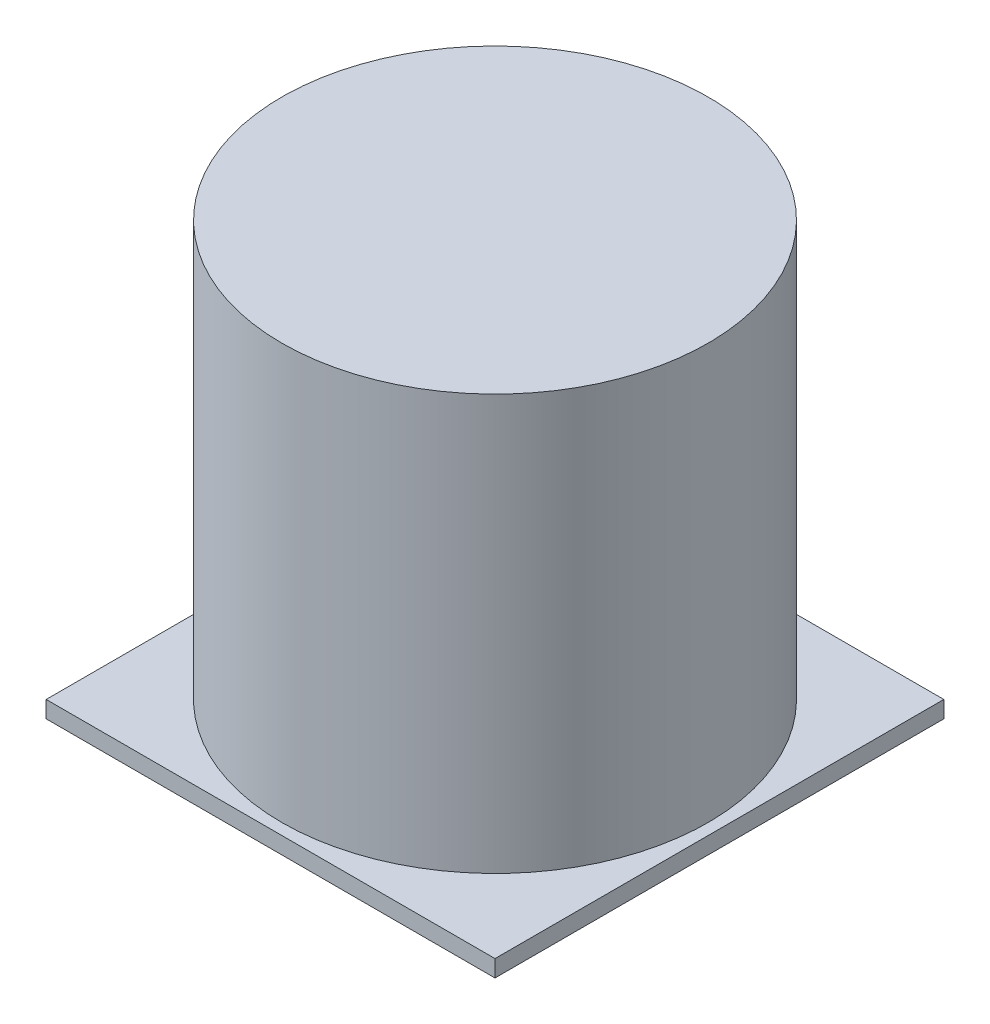
ISO-10303-21;
HEADER;
FILE_DESCRIPTION(('STEP AP214'),'2;1');
FILE_NAME('part.step','',(''),(''),'','','');
FILE_SCHEMA(('AUTOMOTIVE_DESIGN { 1 0 10303 214 1 1 1 1 }'));
ENDSEC;
DATA;
#1=APPLICATION_CONTEXT('core data for automotive mechanical design processes');
#2=APPLICATION_PROTOCOL_DEFINITION('international standard','automotive_design',2000,#1);
#3=PRODUCT_CONTEXT('',#1,'mechanical');
#4=PRODUCT('Part','Part','',(#3));
#5=PRODUCT_RELATED_PRODUCT_CATEGORY('part','',(#4));
#6=PRODUCT_DEFINITION_FORMATION('','',#4);
#7=PRODUCT_DEFINITION_CONTEXT('part definition',#1,'design');
#8=PRODUCT_DEFINITION('design','',#6,#7);
#9=PRODUCT_DEFINITION_SHAPE('','',#8);
#10=(LENGTH_UNIT() NAMED_UNIT(*) SI_UNIT(.MILLI.,.METRE.));
#11=(NAMED_UNIT(*) PLANE_ANGLE_UNIT() SI_UNIT($,.RADIAN.));
#12=(NAMED_UNIT(*) SI_UNIT($,.STERADIAN.) SOLID_ANGLE_UNIT());
#13=UNCERTAINTY_MEASURE_WITH_UNIT(LENGTH_MEASURE(1.E-05),#10,'distance_accuracy_value','');
#14=(GEOMETRIC_REPRESENTATION_CONTEXT(3) GLOBAL_UNCERTAINTY_ASSIGNED_CONTEXT((#13)) GLOBAL_UNIT_ASSIGNED_CONTEXT((#10,
#11,#12)) REPRESENTATION_CONTEXT('',''));
#15=CARTESIAN_POINT('',(0.,0.,0.));
#16=DIRECTION('',(0.,0.,1.));
#17=DIRECTION('',(1.,0.,0.));
#18=AXIS2_PLACEMENT_3D('',#15,#16,#17);
#19=CARTESIAN_POINT('',(0.,3.,0.));
#20=DIRECTION('',(0.,1.,0.));
#21=DIRECTION('',(0.,0.,1.));
#22=AXIS2_PLACEMENT_3D('',#19,#20,#21);
#23=PLANE('',#22);
#24=DIRECTION('',(-1.,0.,0.));
#25=VECTOR('',#24,1.);
#26=CARTESIAN_POINT('',(80.,3.,-40.));
#27=LINE('',#26,#25);
#28=CARTESIAN_POINT('',(80.,3.,-40.));
#29=VERTEX_POINT('',#28);
#30=CARTESIAN_POINT('',(0.,3.,-40.));
#31=VERTEX_POINT('',#30);
#32=EDGE_CURVE('E138',#29,#31,#27,.T.);
#33=ORIENTED_EDGE('',*,*,#32,.T.);
#34=DIRECTION('',(0.,0.,1.));
#35=VECTOR('',#34,1.);
#36=CARTESIAN_POINT('',(0.,3.,-40.));
#37=LINE('',#36,#35);
#38=CARTESIAN_POINT('',(0.,3.,40.));
#39=VERTEX_POINT('',#38);
#40=EDGE_CURVE('E90',#31,#39,#37,.T.);
#41=ORIENTED_EDGE('',*,*,#40,.T.);
#42=DIRECTION('',(1.,0.,0.));
#43=VECTOR('',#42,1.);
#44=CARTESIAN_POINT('',(0.,3.,40.));
#45=LINE('',#44,#43);
#46=CARTESIAN_POINT('',(80.,3.,40.));
#47=VERTEX_POINT('',#46);
#48=EDGE_CURVE('E151',#39,#47,#45,.T.);
#49=ORIENTED_EDGE('',*,*,#48,.T.);
#50=DIRECTION('',(0.,0.,-1.));
#51=VECTOR('',#50,1.);
#52=CARTESIAN_POINT('',(80.,3.,40.));
#53=LINE('',#52,#51);
#54=EDGE_CURVE('E58',#47,#29,#53,.T.);
#55=ORIENTED_EDGE('',*,*,#54,.T.);
#56=EDGE_LOOP('',(#33,#41,#49,#55));
#57=FACE_BOUND('',#56,.T.);
#58=CARTESIAN_POINT('',(40.,3.,0.));
#59=DIRECTION('',(0.,1.,0.));
#60=DIRECTION('',(0.,0.,1.));
#61=AXIS2_PLACEMENT_3D('',#58,#59,#60);
#62=CIRCLE('',#61,38.);
#63=CARTESIAN_POINT('',(40.,3.,38.));
#64=VERTEX_POINT('',#63);
#65=EDGE_CURVE('E142',#64,#64,#62,.T.);
#66=ORIENTED_EDGE('',*,*,#65,.F.);
#67=EDGE_LOOP('',(#66));
#68=FACE_BOUND('',#67,.T.);
#69=ADVANCED_FACE('F40',(#57,#68),#23,.T.);
#70=CARTESIAN_POINT('',(80.,3.,-40.));
#71=DIRECTION('',(0.,0.,1.));
#72=DIRECTION('',(1.,0.,0.));
#73=AXIS2_PLACEMENT_3D('',#70,#71,#72);
#74=PLANE('',#73);
#75=DIRECTION('',(-1.,0.,0.));
#76=VECTOR('',#75,1.);
#77=CARTESIAN_POINT('',(80.,0.,-40.));
#78=LINE('',#77,#76);
#79=CARTESIAN_POINT('',(80.,0.,-40.));
#80=VERTEX_POINT('',#79);
#81=CARTESIAN_POINT('',(0.,0.,-40.));
#82=VERTEX_POINT('',#81);
#83=EDGE_CURVE('E146',#80,#82,#78,.T.);
#84=ORIENTED_EDGE('',*,*,#83,.T.);
#85=DIRECTION('',(0.,-1.,0.));
#86=VECTOR('',#85,1.);
#87=CARTESIAN_POINT('',(0.,3.,-40.));
#88=LINE('',#87,#86);
#89=EDGE_CURVE('E166',#31,#82,#88,.T.);
#90=ORIENTED_EDGE('',*,*,#89,.F.);
#91=ORIENTED_EDGE('',*,*,#32,.F.);
#92=DIRECTION('',(0.,-1.,0.));
#93=VECTOR('',#92,1.);
#94=CARTESIAN_POINT('',(80.,3.,-40.));
#95=LINE('',#94,#93);
#96=EDGE_CURVE('E154',#29,#80,#95,.T.);
#97=ORIENTED_EDGE('',*,*,#96,.T.);
#98=EDGE_LOOP('',(#84,#90,#91,#97));
#99=FACE_BOUND('',#98,.T.);
#100=ADVANCED_FACE('F42',(#99),#74,.F.);
#101=CARTESIAN_POINT('',(0.,3.,-40.));
#102=DIRECTION('',(1.,0.,0.));
#103=DIRECTION('',(0.,0.,-1.));
#104=AXIS2_PLACEMENT_3D('',#101,#102,#103);
#105=PLANE('',#104);
#106=DIRECTION('',(0.,0.,1.));
#107=VECTOR('',#106,1.);
#108=CARTESIAN_POINT('',(0.,0.,-40.));
#109=LINE('',#108,#107);
#110=CARTESIAN_POINT('',(0.,0.,40.));
#111=VERTEX_POINT('',#110);
#112=EDGE_CURVE('E157',#82,#111,#109,.T.);
#113=ORIENTED_EDGE('',*,*,#112,.T.);
#114=DIRECTION('',(0.,-1.,0.));
#115=VECTOR('',#114,1.);
#116=CARTESIAN_POINT('',(0.,3.,40.));
#117=LINE('',#116,#115);
#118=EDGE_CURVE('E164',#39,#111,#117,.T.);
#119=ORIENTED_EDGE('',*,*,#118,.F.);
#120=ORIENTED_EDGE('',*,*,#40,.F.);
#121=ORIENTED_EDGE('',*,*,#89,.T.);
#122=EDGE_LOOP('',(#113,#119,#120,#121));
#123=FACE_BOUND('',#122,.T.);
#124=ADVANCED_FACE('F127',(#123),#105,.F.);
#125=CARTESIAN_POINT('',(0.,3.,40.));
#126=DIRECTION('',(0.,0.,-1.));
#127=DIRECTION('',(-1.,0.,0.));
#128=AXIS2_PLACEMENT_3D('',#125,#126,#127);
#129=PLANE('',#128);
#130=DIRECTION('',(1.,0.,0.));
#131=VECTOR('',#130,1.);
#132=CARTESIAN_POINT('',(0.,0.,40.));
#133=LINE('',#132,#131);
#134=CARTESIAN_POINT('',(80.,0.,40.));
#135=VERTEX_POINT('',#134);
#136=EDGE_CURVE('E76',#111,#135,#133,.T.);
#137=ORIENTED_EDGE('',*,*,#136,.T.);
#138=DIRECTION('',(0.,-1.,0.));
#139=VECTOR('',#138,1.);
#140=CARTESIAN_POINT('',(80.,3.,40.));
#141=LINE('',#140,#139);
#142=EDGE_CURVE('E162',#47,#135,#141,.T.);
#143=ORIENTED_EDGE('',*,*,#142,.F.);
#144=ORIENTED_EDGE('',*,*,#48,.F.);
#145=ORIENTED_EDGE('',*,*,#118,.T.);
#146=EDGE_LOOP('',(#137,#143,#144,#145));
#147=FACE_BOUND('',#146,.T.);
#148=ADVANCED_FACE('F125',(#147),#129,.F.);
#149=CARTESIAN_POINT('',(80.,3.,40.));
#150=DIRECTION('',(-1.,0.,0.));
#151=DIRECTION('',(0.,0.,1.));
#152=AXIS2_PLACEMENT_3D('',#149,#150,#151);
#153=PLANE('',#152);
#154=DIRECTION('',(0.,0.,-1.));
#155=VECTOR('',#154,1.);
#156=CARTESIAN_POINT('',(80.,0.,40.));
#157=LINE('',#156,#155);
#158=EDGE_CURVE('E82',#135,#80,#157,.T.);
#159=ORIENTED_EDGE('',*,*,#158,.T.);
#160=ORIENTED_EDGE('',*,*,#96,.F.);
#161=ORIENTED_EDGE('',*,*,#54,.F.);
#162=ORIENTED_EDGE('',*,*,#142,.T.);
#163=EDGE_LOOP('',(#159,#160,#161,#162));
#164=FACE_BOUND('',#163,.T.);
#165=ADVANCED_FACE('F121',(#164),#153,.F.);
#166=CARTESIAN_POINT('',(0.,0.,0.));
#167=DIRECTION('',(0.,1.,0.));
#168=DIRECTION('',(0.,0.,1.));
#169=AXIS2_PLACEMENT_3D('',#166,#167,#168);
#170=PLANE('',#169);
#171=ORIENTED_EDGE('',*,*,#83,.F.);
#172=ORIENTED_EDGE('',*,*,#158,.F.);
#173=ORIENTED_EDGE('',*,*,#136,.F.);
#174=ORIENTED_EDGE('',*,*,#112,.F.);
#175=EDGE_LOOP('',(#171,#172,#173,#174));
#176=FACE_BOUND('',#175,.T.);
#177=ADVANCED_FACE('F115',(#176),#170,.F.);
#178=CARTESIAN_POINT('',(40.,77.,0.));
#179=DIRECTION('',(0.,1.,0.));
#180=DIRECTION('',(0.,0.,1.));
#181=AXIS2_PLACEMENT_3D('',#178,#179,#180);
#182=PLANE('',#181);
#183=CARTESIAN_POINT('',(40.,77.,0.));
#184=DIRECTION('',(0.,1.,0.));
#185=DIRECTION('',(0.,0.,1.));
#186=AXIS2_PLACEMENT_3D('',#183,#184,#185);
#187=CIRCLE('',#186,38.);
#188=CARTESIAN_POINT('',(40.,77.,38.));
#189=VERTEX_POINT('',#188);
#190=EDGE_CURVE('E143',#189,#189,#187,.T.);
#191=ORIENTED_EDGE('',*,*,#190,.T.);
#192=EDGE_LOOP('',(#191));
#193=FACE_BOUND('',#192,.T.);
#194=ADVANCED_FACE('F111',(#193),#182,.T.);
#195=CARTESIAN_POINT('',(40.,77.,0.));
#196=DIRECTION('',(0.,-1.,0.));
#197=DIRECTION('',(0.,0.,-1.));
#198=AXIS2_PLACEMENT_3D('',#195,#196,#197);
#199=CYLINDRICAL_SURFACE('',#198,38.);
#200=ORIENTED_EDGE('',*,*,#65,.T.);
#201=EDGE_LOOP('',(#200));
#202=FACE_BOUND('',#201,.T.);
#203=ORIENTED_EDGE('',*,*,#190,.F.);
#204=EDGE_LOOP('',(#203));
#205=FACE_BOUND('',#204,.T.);
#206=ADVANCED_FACE('F114',(#202,#205),#199,.T.);
#207=CLOSED_SHELL('',(#69,#100,#124,#148,#165,#177,#194,#206));
#208=CARTESIAN_POINT('',(40.,36.0000000000001,0.));
#209=DIRECTION('',(0.,-1.,0.));
#210=DIRECTION('',(0.,0.,-1.));
#211=AXIS2_PLACEMENT_3D('',#208,#209,#210);
#212=CONICAL_SURFACE('',#211,38.,0.78539816339745);
#213=CARTESIAN_POINT('',(40.,39.0000000000001,0.));
#214=DIRECTION('',(0.,-1.,0.));
#215=DIRECTION('',(0.,0.,-1.));
#216=AXIS2_PLACEMENT_3D('',#213,#214,#215);
#217=CIRCLE('',#216,35.);
#218=CARTESIAN_POINT('',(40.,39.0000000000001,-35.));
#219=VERTEX_POINT('',#218);
#220=EDGE_CURVE('E12',#219,#219,#217,.T.);
#221=ORIENTED_EDGE('',*,*,#220,.T.);
#222=EDGE_LOOP('',(#221));
#223=FACE_BOUND('',#222,.T.);
#224=CARTESIAN_POINT('',(40.,74.,0.));
#225=VERTEX_POINT('',#224);
#226=VERTEX_LOOP('',#225);
#227=FACE_BOUND('',#226,.T.);
#228=ADVANCED_FACE('F94',(#223,#227),#212,.F.);
#229=CARTESIAN_POINT('',(40.,3.,0.));
#230=DIRECTION('',(0.,1.,0.));
#231=DIRECTION('',(0.,0.,1.));
#232=AXIS2_PLACEMENT_3D('',#229,#230,#231);
#233=CIRCLE('',#232,35.);
#234=CARTESIAN_POINT('',(40.,3.,35.));
#235=VERTEX_POINT('',#234);
#236=EDGE_CURVE('E50',#235,#235,#233,.F.);
#237=ORIENTED_EDGE('',*,*,#236,.F.);
#238=EDGE_LOOP('',(#237));
#239=FACE_BOUND('',#238,.T.);
#240=ADVANCED_FACE('F96',(#239),#23,.T.);
#241=CARTESIAN_POINT('',(40.,77.,0.));
#242=DIRECTION('',(0.,-1.,0.));
#243=DIRECTION('',(0.,0.,-1.));
#244=AXIS2_PLACEMENT_3D('',#241,#242,#243);
#245=CYLINDRICAL_SURFACE('',#244,35.);
#246=ORIENTED_EDGE('',*,*,#220,.F.);
#247=EDGE_LOOP('',(#246));
#248=FACE_BOUND('',#247,.T.);
#249=ORIENTED_EDGE('',*,*,#236,.T.);
#250=EDGE_LOOP('',(#249));
#251=FACE_BOUND('',#250,.T.);
#252=ADVANCED_FACE('F104',(#248,#251),#245,.F.);
#253=CLOSED_SHELL('',(#228,#240,#252));
#254=ORIENTED_CLOSED_SHELL('',*,#253,.T.);
#255=BREP_WITH_VOIDS('B2',#207,(#254));
#256=ADVANCED_BREP_SHAPE_REPRESENTATION('',(#18,#255),#14);
#257=SHAPE_DEFINITION_REPRESENTATION(#9,#256);
ENDSEC;
END-ISO-10303-21;
